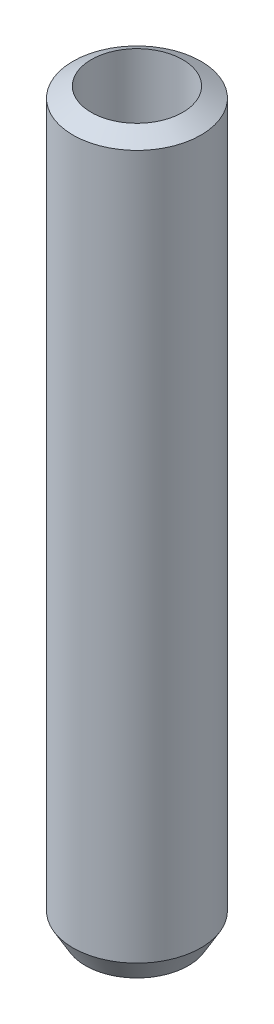
ISO-10303-21;
HEADER;
FILE_DESCRIPTION(('STEP AP214'),'2;1');
FILE_NAME('part.step','',(''),(''),'','','');
FILE_SCHEMA(('AUTOMOTIVE_DESIGN { 1 0 10303 214 1 1 1 1 }'));
ENDSEC;
DATA;
#1=APPLICATION_CONTEXT('core data for automotive mechanical design processes');
#2=APPLICATION_PROTOCOL_DEFINITION('international standard','automotive_design',2000,#1);
#3=PRODUCT_CONTEXT('',#1,'mechanical');
#4=PRODUCT('Part','Part','',(#3));
#5=PRODUCT_RELATED_PRODUCT_CATEGORY('part','',(#4));
#6=PRODUCT_DEFINITION_FORMATION('','',#4);
#7=PRODUCT_DEFINITION_CONTEXT('part definition',#1,'design');
#8=PRODUCT_DEFINITION('design','',#6,#7);
#9=PRODUCT_DEFINITION_SHAPE('','',#8);
#10=(LENGTH_UNIT() NAMED_UNIT(*) SI_UNIT(.MILLI.,.METRE.));
#11=(NAMED_UNIT(*) PLANE_ANGLE_UNIT() SI_UNIT($,.RADIAN.));
#12=(NAMED_UNIT(*) SI_UNIT($,.STERADIAN.) SOLID_ANGLE_UNIT());
#13=UNCERTAINTY_MEASURE_WITH_UNIT(LENGTH_MEASURE(1.E-05),#10,'distance_accuracy_value','');
#14=(GEOMETRIC_REPRESENTATION_CONTEXT(3) GLOBAL_UNCERTAINTY_ASSIGNED_CONTEXT((#13)) GLOBAL_UNIT_ASSIGNED_CONTEXT((#10,
#11,#12)) REPRESENTATION_CONTEXT('',''));
#15=CARTESIAN_POINT('',(0.,0.,0.));
#16=DIRECTION('',(0.,0.,1.));
#17=DIRECTION('',(1.,0.,0.));
#18=AXIS2_PLACEMENT_3D('',#15,#16,#17);
#19=CARTESIAN_POINT('',(0.,317.215559297819,0.));
#20=DIRECTION('',(0.,-1.,0.));
#21=DIRECTION('',(0.,0.,-1.));
#22=AXIS2_PLACEMENT_3D('',#19,#20,#21);
#23=CYLINDRICAL_SURFACE('',#22,27.5);
#24=CARTESIAN_POINT('',(0.,311.825269894068,0.));
#25=DIRECTION('',(0.,1.,0.));
#26=DIRECTION('',(0.,0.,1.));
#27=AXIS2_PLACEMENT_3D('',#24,#25,#26);
#28=CIRCLE('',#27,27.5);
#29=CARTESIAN_POINT('',(0.,311.825269894068,27.5));
#30=VERTEX_POINT('',#29);
#31=EDGE_CURVE('E50',#30,#30,#28,.F.);
#32=ORIENTED_EDGE('',*,*,#31,.T.);
#33=EDGE_LOOP('',(#32));
#34=FACE_BOUND('',#33,.T.);
#35=CARTESIAN_POINT('',(0.,9.33625511479819,0.));
#36=DIRECTION('',(0.,1.,0.));
#37=DIRECTION('',(0.,0.,1.));
#38=AXIS2_PLACEMENT_3D('',#35,#36,#37);
#39=CIRCLE('',#38,27.5);
#40=CARTESIAN_POINT('',(0.,9.33625511479819,27.5));
#41=VERTEX_POINT('',#40);
#42=EDGE_CURVE('E51',#41,#41,#39,.T.);
#43=ORIENTED_EDGE('',*,*,#42,.T.);
#44=EDGE_LOOP('',(#43));
#45=FACE_BOUND('',#44,.T.);
#46=ADVANCED_FACE('F39',(#34,#45),#23,.T.);
#47=CARTESIAN_POINT('',(0.,0.,0.));
#48=DIRECTION('',(0.,1.,0.));
#49=DIRECTION('',(0.,0.,1.));
#50=AXIS2_PLACEMENT_3D('',#47,#48,#49);
#51=PLANE('',#50);
#52=CARTESIAN_POINT('',(0.,0.,0.));
#53=DIRECTION('',(0.,1.,0.));
#54=DIRECTION('',(0.,0.,1.));
#55=AXIS2_PLACEMENT_3D('',#52,#53,#54);
#56=CIRCLE('',#55,22.1097105962482);
#57=CARTESIAN_POINT('',(0.,0.,22.1097105962482));
#58=VERTEX_POINT('',#57);
#59=EDGE_CURVE('E10',#58,#58,#56,.F.);
#60=ORIENTED_EDGE('',*,*,#59,.T.);
#61=EDGE_LOOP('',(#60));
#62=FACE_BOUND('',#61,.T.);
#63=CARTESIAN_POINT('',(0.,0.,0.));
#64=DIRECTION('',(0.,1.,0.));
#65=DIRECTION('',(0.,0.,1.));
#66=AXIS2_PLACEMENT_3D('',#63,#64,#65);
#67=CIRCLE('',#66,19.6586115679238);
#68=CARTESIAN_POINT('',(0.,0.,19.6586115679238));
#69=VERTEX_POINT('',#68);
#70=EDGE_CURVE('E58',#69,#69,#67,.T.);
#71=ORIENTED_EDGE('',*,*,#70,.T.);
#72=EDGE_LOOP('',(#71));
#73=FACE_BOUND('',#72,.T.);
#74=ADVANCED_FACE('F62',(#62,#73),#51,.F.);
#75=CARTESIAN_POINT('',(0.,317.215559297819,0.));
#76=DIRECTION('',(0.,-1.,0.));
#77=DIRECTION('',(0.,0.,-1.));
#78=AXIS2_PLACEMENT_3D('',#75,#76,#77);
#79=CYLINDRICAL_SURFACE('',#78,19.6586115679238);
#80=CARTESIAN_POINT('',(0.,316.352497616147,0.));
#81=DIRECTION('',(0.,-1.,0.));
#82=DIRECTION('',(0.,0.,-1.));
#83=AXIS2_PLACEMENT_3D('',#80,#81,#82);
#84=CIRCLE('',#83,19.6586115679238);
#85=CARTESIAN_POINT('',(0.,316.352497616147,-19.6586115679238));
#86=VERTEX_POINT('',#85);
#87=EDGE_CURVE('E54',#86,#86,#84,.F.);
#88=ORIENTED_EDGE('',*,*,#87,.T.);
#89=EDGE_LOOP('',(#88));
#90=FACE_BOUND('',#89,.T.);
#91=ORIENTED_EDGE('',*,*,#70,.F.);
#92=EDGE_LOOP('',(#91));
#93=FACE_BOUND('',#92,.T.);
#94=ADVANCED_FACE('F68',(#90,#93),#79,.F.);
#95=CARTESIAN_POINT('',(0.,317.215559297819,0.));
#96=DIRECTION('',(0.,-1.,0.));
#97=DIRECTION('',(0.,0.,-1.));
#98=AXIS2_PLACEMENT_3D('',#95,#96,#97);
#99=CONICAL_SURFACE('',#98,18.1637448852017,1.0471975511966);
#100=ORIENTED_EDGE('',*,*,#31,.F.);
#101=EDGE_LOOP('',(#100));
#102=FACE_BOUND('',#101,.T.);
#103=ORIENTED_EDGE('',*,*,#87,.F.);
#104=EDGE_LOOP('',(#103));
#105=FACE_BOUND('',#104,.T.);
#106=ADVANCED_FACE('F66',(#102,#105),#99,.T.);
#107=CARTESIAN_POINT('',(0.,9.33625511479819,0.));
#108=DIRECTION('',(0.,1.,0.));
#109=DIRECTION('',(0.,0.,1.));
#110=AXIS2_PLACEMENT_3D('',#107,#108,#109);
#111=CONICAL_SURFACE('',#110,27.5,0.523598775598301);
#112=ORIENTED_EDGE('',*,*,#59,.F.);
#113=EDGE_LOOP('',(#112));
#114=FACE_BOUND('',#113,.T.);
#115=ORIENTED_EDGE('',*,*,#42,.F.);
#116=EDGE_LOOP('',(#115));
#117=FACE_BOUND('',#116,.T.);
#118=ADVANCED_FACE('F45',(#114,#117),#111,.T.);
#119=CLOSED_SHELL('',(#46,#74,#94,#106,#118));
#120=MANIFOLD_SOLID_BREP('B2',#119);
#121=ADVANCED_BREP_SHAPE_REPRESENTATION('',(#18,#120),#14);
#122=SHAPE_DEFINITION_REPRESENTATION(#9,#121);
ENDSEC;
END-ISO-10303-21;
